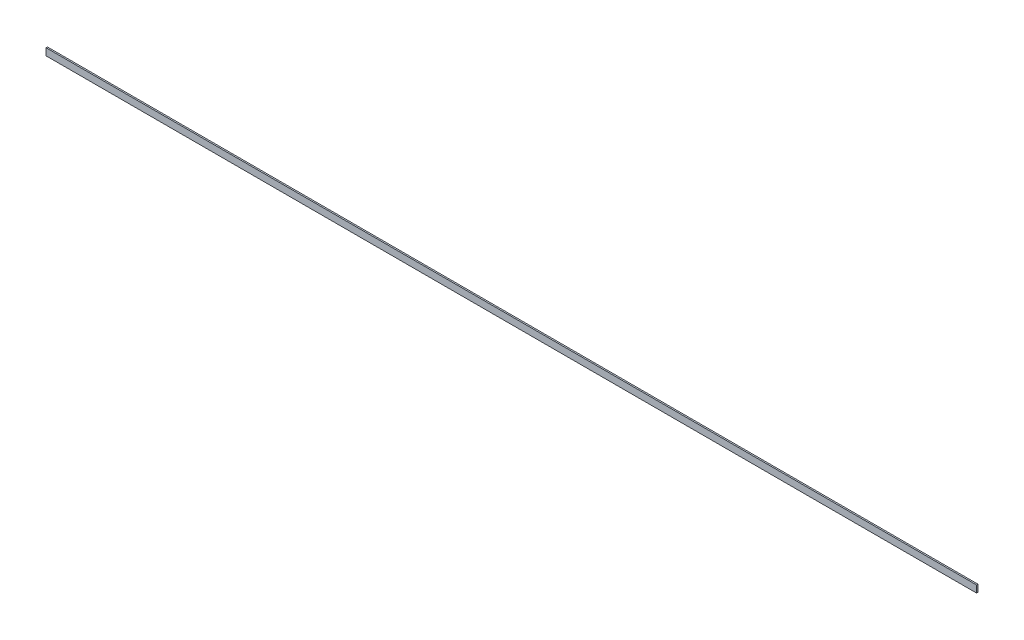
ISO-10303-21;
HEADER;
FILE_DESCRIPTION(('STEP AP214'),'2;1');
FILE_NAME('part.step','',(''),(''),'','','');
FILE_SCHEMA(('AUTOMOTIVE_DESIGN { 1 0 10303 214 1 1 1 1 }'));
ENDSEC;
DATA;
#1=APPLICATION_CONTEXT('core data for automotive mechanical design processes');
#2=APPLICATION_PROTOCOL_DEFINITION('international standard','automotive_design',2000,#1);
#3=PRODUCT_CONTEXT('',#1,'mechanical');
#4=PRODUCT('Part','Part','',(#3));
#5=PRODUCT_RELATED_PRODUCT_CATEGORY('part','',(#4));
#6=PRODUCT_DEFINITION_FORMATION('','',#4);
#7=PRODUCT_DEFINITION_CONTEXT('part definition',#1,'design');
#8=PRODUCT_DEFINITION('design','',#6,#7);
#9=PRODUCT_DEFINITION_SHAPE('','',#8);
#10=(LENGTH_UNIT() NAMED_UNIT(*) SI_UNIT(.MILLI.,.METRE.));
#11=(NAMED_UNIT(*) PLANE_ANGLE_UNIT() SI_UNIT($,.RADIAN.));
#12=(NAMED_UNIT(*) SI_UNIT($,.STERADIAN.) SOLID_ANGLE_UNIT());
#13=UNCERTAINTY_MEASURE_WITH_UNIT(LENGTH_MEASURE(1.E-05),#10,'distance_accuracy_value','');
#14=(GEOMETRIC_REPRESENTATION_CONTEXT(3) GLOBAL_UNCERTAINTY_ASSIGNED_CONTEXT((#13)) GLOBAL_UNIT_ASSIGNED_CONTEXT((#10,
#11,#12)) REPRESENTATION_CONTEXT('',''));
#15=CARTESIAN_POINT('',(0.,0.,0.));
#16=DIRECTION('',(0.,0.,1.));
#17=DIRECTION('',(1.,0.,0.));
#18=AXIS2_PLACEMENT_3D('',#15,#16,#17);
#19=CARTESIAN_POINT('',(2650.,0.,0.));
#20=DIRECTION('',(0.,0.,-1.));
#21=DIRECTION('',(-1.,0.,0.));
#22=AXIS2_PLACEMENT_3D('',#19,#20,#21);
#23=PLANE('',#22);
#24=DIRECTION('',(0.,-1.,0.));
#25=VECTOR('',#24,1.);
#26=CARTESIAN_POINT('',(0.,0.,0.));
#27=LINE('',#26,#25);
#28=CARTESIAN_POINT('',(0.,20.,0.));
#29=VERTEX_POINT('',#28);
#30=CARTESIAN_POINT('',(0.,0.,0.));
#31=VERTEX_POINT('',#30);
#32=EDGE_CURVE('E101',#29,#31,#27,.T.);
#33=ORIENTED_EDGE('',*,*,#32,.T.);
#34=DIRECTION('',(-1.,0.,0.));
#35=VECTOR('',#34,1.);
#36=CARTESIAN_POINT('',(2650.,0.,0.));
#37=LINE('',#36,#35);
#38=CARTESIAN_POINT('',(2650.,0.,0.));
#39=VERTEX_POINT('',#38);
#40=EDGE_CURVE('E11',#39,#31,#37,.T.);
#41=ORIENTED_EDGE('',*,*,#40,.F.);
#42=DIRECTION('',(0.,-1.,0.));
#43=VECTOR('',#42,1.);
#44=CARTESIAN_POINT('',(2650.,0.,0.));
#45=LINE('',#44,#43);
#46=CARTESIAN_POINT('',(2650.,20.,0.));
#47=VERTEX_POINT('',#46);
#48=EDGE_CURVE('E88',#47,#39,#45,.T.);
#49=ORIENTED_EDGE('',*,*,#48,.F.);
#50=DIRECTION('',(-1.,0.,0.));
#51=VECTOR('',#50,1.);
#52=CARTESIAN_POINT('',(2650.,20.,0.));
#53=LINE('',#52,#51);
#54=EDGE_CURVE('E97',#47,#29,#53,.T.);
#55=ORIENTED_EDGE('',*,*,#54,.T.);
#56=EDGE_LOOP('',(#33,#41,#49,#55));
#57=FACE_BOUND('',#56,.T.);
#58=ADVANCED_FACE('F36',(#57),#23,.F.);
#59=CARTESIAN_POINT('',(2650.,0.,0.));
#60=DIRECTION('',(0.,1.,0.));
#61=DIRECTION('',(0.,0.,1.));
#62=AXIS2_PLACEMENT_3D('',#59,#60,#61);
#63=PLANE('',#62);
#64=DIRECTION('',(0.,0.,-1.));
#65=VECTOR('',#64,1.);
#66=CARTESIAN_POINT('',(0.,0.,0.));
#67=LINE('',#66,#65);
#68=CARTESIAN_POINT('',(0.,0.,-4.));
#69=VERTEX_POINT('',#68);
#70=EDGE_CURVE('E92',#31,#69,#67,.T.);
#71=ORIENTED_EDGE('',*,*,#70,.T.);
#72=DIRECTION('',(-1.,0.,0.));
#73=VECTOR('',#72,1.);
#74=CARTESIAN_POINT('',(2650.,0.,-4.));
#75=LINE('',#74,#73);
#76=CARTESIAN_POINT('',(2650.,0.,-4.));
#77=VERTEX_POINT('',#76);
#78=EDGE_CURVE('E45',#77,#69,#75,.T.);
#79=ORIENTED_EDGE('',*,*,#78,.F.);
#80=DIRECTION('',(0.,0.,-1.));
#81=VECTOR('',#80,1.);
#82=CARTESIAN_POINT('',(2650.,0.,0.));
#83=LINE('',#82,#81);
#84=EDGE_CURVE('E83',#39,#77,#83,.T.);
#85=ORIENTED_EDGE('',*,*,#84,.F.);
#86=ORIENTED_EDGE('',*,*,#40,.T.);
#87=EDGE_LOOP('',(#71,#79,#85,#86));
#88=FACE_BOUND('',#87,.T.);
#89=ADVANCED_FACE('F91',(#88),#63,.F.);
#90=CARTESIAN_POINT('',(2650.,0.,-4.));
#91=DIRECTION('',(0.,0.,1.));
#92=DIRECTION('',(1.,0.,0.));
#93=AXIS2_PLACEMENT_3D('',#90,#91,#92);
#94=PLANE('',#93);
#95=DIRECTION('',(0.,1.,0.));
#96=VECTOR('',#95,1.);
#97=CARTESIAN_POINT('',(0.,0.,-4.));
#98=LINE('',#97,#96);
#99=CARTESIAN_POINT('',(0.,20.,-4.));
#100=VERTEX_POINT('',#99);
#101=EDGE_CURVE('E70',#69,#100,#98,.T.);
#102=ORIENTED_EDGE('',*,*,#101,.T.);
#103=DIRECTION('',(-1.,0.,0.));
#104=VECTOR('',#103,1.);
#105=CARTESIAN_POINT('',(2650.,20.,-4.));
#106=LINE('',#105,#104);
#107=CARTESIAN_POINT('',(2650.,20.,-4.));
#108=VERTEX_POINT('',#107);
#109=EDGE_CURVE('E94',#108,#100,#106,.T.);
#110=ORIENTED_EDGE('',*,*,#109,.F.);
#111=DIRECTION('',(0.,1.,0.));
#112=VECTOR('',#111,1.);
#113=CARTESIAN_POINT('',(2650.,0.,-4.));
#114=LINE('',#113,#112);
#115=EDGE_CURVE('E86',#77,#108,#114,.T.);
#116=ORIENTED_EDGE('',*,*,#115,.F.);
#117=ORIENTED_EDGE('',*,*,#78,.T.);
#118=EDGE_LOOP('',(#102,#110,#116,#117));
#119=FACE_BOUND('',#118,.T.);
#120=ADVANCED_FACE('F95',(#119),#94,.F.);
#121=CARTESIAN_POINT('',(2650.,20.,0.));
#122=DIRECTION('',(0.,-1.,0.));
#123=DIRECTION('',(0.,0.,-1.));
#124=AXIS2_PLACEMENT_3D('',#121,#122,#123);
#125=PLANE('',#124);
#126=DIRECTION('',(0.,0.,1.));
#127=VECTOR('',#126,1.);
#128=CARTESIAN_POINT('',(0.,20.,0.));
#129=LINE('',#128,#127);
#130=EDGE_CURVE('E76',#100,#29,#129,.T.);
#131=ORIENTED_EDGE('',*,*,#130,.T.);
#132=ORIENTED_EDGE('',*,*,#54,.F.);
#133=DIRECTION('',(0.,0.,1.));
#134=VECTOR('',#133,1.);
#135=CARTESIAN_POINT('',(2650.,20.,0.));
#136=LINE('',#135,#134);
#137=EDGE_CURVE('E53',#108,#47,#136,.T.);
#138=ORIENTED_EDGE('',*,*,#137,.F.);
#139=ORIENTED_EDGE('',*,*,#109,.T.);
#140=EDGE_LOOP('',(#131,#132,#138,#139));
#141=FACE_BOUND('',#140,.T.);
#142=ADVANCED_FACE('F110',(#141),#125,.F.);
#143=CARTESIAN_POINT('',(2650.,0.,0.));
#144=DIRECTION('',(-1.,0.,0.));
#145=DIRECTION('',(0.,0.,1.));
#146=AXIS2_PLACEMENT_3D('',#143,#144,#145);
#147=PLANE('',#146);
#148=ORIENTED_EDGE('',*,*,#48,.T.);
#149=ORIENTED_EDGE('',*,*,#84,.T.);
#150=ORIENTED_EDGE('',*,*,#115,.T.);
#151=ORIENTED_EDGE('',*,*,#137,.T.);
#152=EDGE_LOOP('',(#148,#149,#150,#151));
#153=FACE_BOUND('',#152,.T.);
#154=ADVANCED_FACE('F84',(#153),#147,.F.);
#155=CARTESIAN_POINT('',(0.,0.,0.));
#156=DIRECTION('',(-1.,0.,0.));
#157=DIRECTION('',(0.,0.,1.));
#158=AXIS2_PLACEMENT_3D('',#155,#156,#157);
#159=PLANE('',#158);
#160=ORIENTED_EDGE('',*,*,#32,.F.);
#161=ORIENTED_EDGE('',*,*,#130,.F.);
#162=ORIENTED_EDGE('',*,*,#101,.F.);
#163=ORIENTED_EDGE('',*,*,#70,.F.);
#164=EDGE_LOOP('',(#160,#161,#162,#163));
#165=FACE_BOUND('',#164,.T.);
#166=ADVANCED_FACE('F113',(#165),#159,.T.);
#167=CLOSED_SHELL('',(#58,#89,#120,#142,#154,#166));
#168=MANIFOLD_SOLID_BREP('B2',#167);
#169=ADVANCED_BREP_SHAPE_REPRESENTATION('',(#18,#168),#14);
#170=SHAPE_DEFINITION_REPRESENTATION(#9,#169);
ENDSEC;
END-ISO-10303-21;
